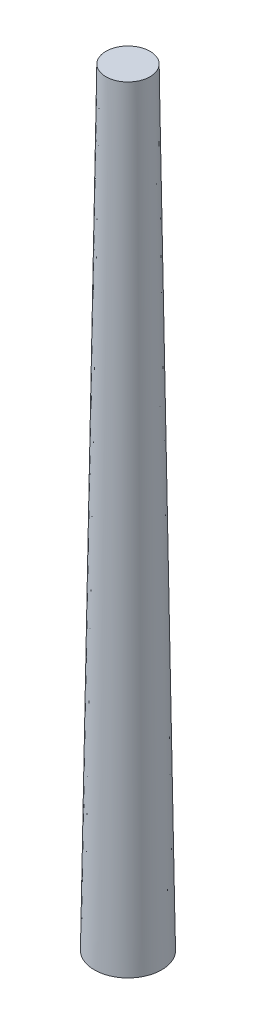
ISO-10303-21;
HEADER;
FILE_DESCRIPTION(('STEP AP214'),'2;1');
FILE_NAME('part.step','',(''),(''),'','','');
FILE_SCHEMA(('AUTOMOTIVE_DESIGN { 1 0 10303 214 1 1 1 1 }'));
ENDSEC;
DATA;
#1=APPLICATION_CONTEXT('core data for automotive mechanical design processes');
#2=APPLICATION_PROTOCOL_DEFINITION('international standard','automotive_design',2000,#1);
#3=PRODUCT_CONTEXT('',#1,'mechanical');
#4=PRODUCT('Part','Part','',(#3));
#5=PRODUCT_RELATED_PRODUCT_CATEGORY('part','',(#4));
#6=PRODUCT_DEFINITION_FORMATION('','',#4);
#7=PRODUCT_DEFINITION_CONTEXT('part definition',#1,'design');
#8=PRODUCT_DEFINITION('design','',#6,#7);
#9=PRODUCT_DEFINITION_SHAPE('','',#8);
#10=(LENGTH_UNIT() NAMED_UNIT(*) SI_UNIT(.MILLI.,.METRE.));
#11=(NAMED_UNIT(*) PLANE_ANGLE_UNIT() SI_UNIT($,.RADIAN.));
#12=(NAMED_UNIT(*) SI_UNIT($,.STERADIAN.) SOLID_ANGLE_UNIT());
#13=UNCERTAINTY_MEASURE_WITH_UNIT(LENGTH_MEASURE(1.E-05),#10,'distance_accuracy_value','');
#14=(GEOMETRIC_REPRESENTATION_CONTEXT(3) GLOBAL_UNCERTAINTY_ASSIGNED_CONTEXT((#13)) GLOBAL_UNIT_ASSIGNED_CONTEXT((#10,
#11,#12)) REPRESENTATION_CONTEXT('',''));
#15=CARTESIAN_POINT('',(0.,0.,0.));
#16=DIRECTION('',(0.,0.,1.));
#17=DIRECTION('',(1.,0.,0.));
#18=AXIS2_PLACEMENT_3D('',#15,#16,#17);
#19=CARTESIAN_POINT('',(0.,0.,0.));
#20=DIRECTION('',(0.,1.,0.));
#21=DIRECTION('',(-1.,0.,0.));
#22=AXIS2_PLACEMENT_3D('',#19,#20,#21);
#23=PLANE('',#22);
#24=CARTESIAN_POINT('',(0.,0.,0.));
#25=DIRECTION('',(0.,1.,0.));
#26=DIRECTION('',(-1.,0.,0.));
#27=AXIS2_PLACEMENT_3D('',#24,#25,#26);
#28=CIRCLE('',#27,6.5405);
#29=CARTESIAN_POINT('',(-6.5405,0.,0.));
#30=VERTEX_POINT('',#29);
#31=EDGE_CURVE('E10',#30,#30,#28,.T.);
#32=ORIENTED_EDGE('',*,*,#31,.F.);
#33=EDGE_LOOP('',(#32));
#34=FACE_BOUND('',#33,.T.);
#35=ADVANCED_FACE('F43',(#34),#23,.F.);
#36=CARTESIAN_POINT('',(0.,0.,0.));
#37=DIRECTION('',(0.,-1.,0.));
#38=DIRECTION('',(1.,0.,0.));
#39=AXIS2_PLACEMENT_3D('',#36,#37,#38);
#40=CONICAL_SURFACE('',#39,6.5405,0.0151052340297037);
#41=CARTESIAN_POINT('',(0.,149.225,0.));
#42=DIRECTION('',(0.,1.,0.));
#43=DIRECTION('',(-1.,0.,0.));
#44=AXIS2_PLACEMENT_3D('',#41,#42,#43);
#45=CIRCLE('',#44,4.28625);
#46=CARTESIAN_POINT('',(-4.28625000000002,149.225,0.));
#47=VERTEX_POINT('',#46);
#48=EDGE_CURVE('E50',#47,#47,#45,.T.);
#49=ORIENTED_EDGE('',*,*,#48,.F.);
#50=EDGE_LOOP('',(#49));
#51=FACE_BOUND('',#50,.T.);
#52=ORIENTED_EDGE('',*,*,#31,.T.);
#53=EDGE_LOOP('',(#52));
#54=FACE_BOUND('',#53,.T.);
#55=ADVANCED_FACE('F59',(#51,#54),#40,.T.);
#56=CARTESIAN_POINT('',(4.28624999999998,149.225,0.));
#57=DIRECTION('',(0.,-1.,0.));
#58=DIRECTION('',(1.,0.,0.));
#59=AXIS2_PLACEMENT_3D('',#56,#57,#58);
#60=PLANE('',#59);
#61=ORIENTED_EDGE('',*,*,#48,.T.);
#62=EDGE_LOOP('',(#61));
#63=FACE_BOUND('',#62,.T.);
#64=ADVANCED_FACE('F57',(#63),#60,.F.);
#65=CLOSED_SHELL('',(#35,#55,#64));
#66=MANIFOLD_SOLID_BREP('B2',#65);
#67=ADVANCED_BREP_SHAPE_REPRESENTATION('',(#18,#66),#14);
#68=SHAPE_DEFINITION_REPRESENTATION(#9,#67);
ENDSEC;
END-ISO-10303-21;
